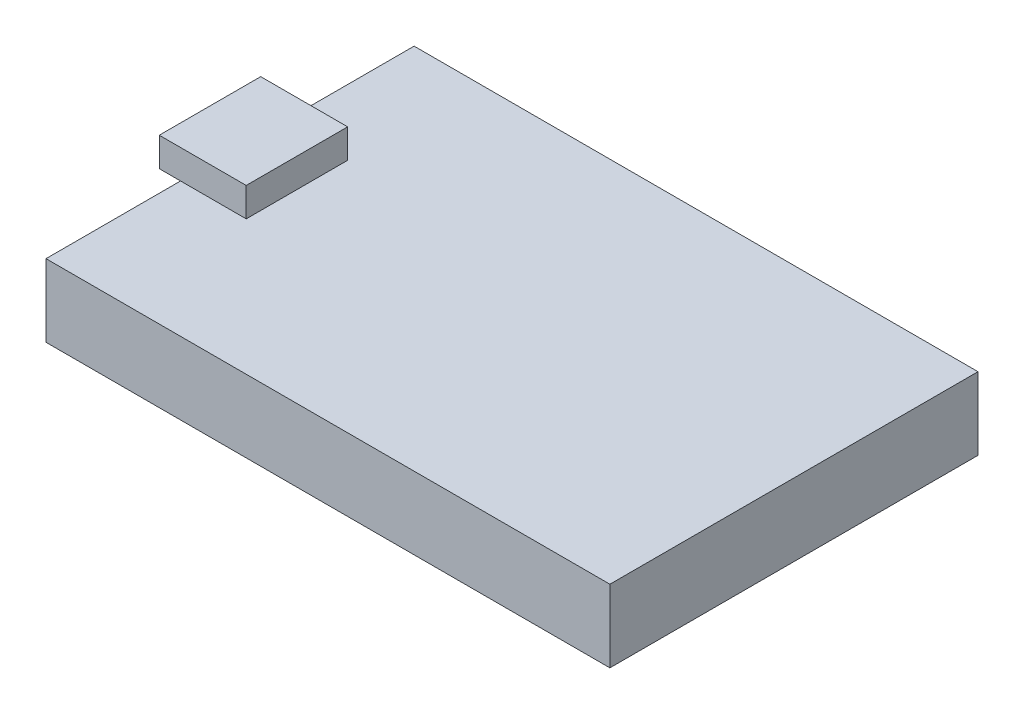
ISO-10303-21;
HEADER;
FILE_DESCRIPTION(('STEP AP214'),'2;1');
FILE_NAME('part.step','',(''),(''),'','','');
FILE_SCHEMA(('AUTOMOTIVE_DESIGN { 1 0 10303 214 1 1 1 1 }'));
ENDSEC;
DATA;
#1=APPLICATION_CONTEXT('core data for automotive mechanical design processes');
#2=APPLICATION_PROTOCOL_DEFINITION('international standard','automotive_design',2000,#1);
#3=PRODUCT_CONTEXT('',#1,'mechanical');
#4=PRODUCT('Part','Part','',(#3));
#5=PRODUCT_RELATED_PRODUCT_CATEGORY('part','',(#4));
#6=PRODUCT_DEFINITION_FORMATION('','',#4);
#7=PRODUCT_DEFINITION_CONTEXT('part definition',#1,'design');
#8=PRODUCT_DEFINITION('design','',#6,#7);
#9=PRODUCT_DEFINITION_SHAPE('','',#8);
#10=(LENGTH_UNIT() NAMED_UNIT(*) SI_UNIT(.MILLI.,.METRE.));
#11=(NAMED_UNIT(*) PLANE_ANGLE_UNIT() SI_UNIT($,.RADIAN.));
#12=(NAMED_UNIT(*) SI_UNIT($,.STERADIAN.) SOLID_ANGLE_UNIT());
#13=UNCERTAINTY_MEASURE_WITH_UNIT(LENGTH_MEASURE(1.E-05),#10,'distance_accuracy_value','');
#14=(GEOMETRIC_REPRESENTATION_CONTEXT(3) GLOBAL_UNCERTAINTY_ASSIGNED_CONTEXT((#13)) GLOBAL_UNIT_ASSIGNED_CONTEXT((#10,
#11,#12)) REPRESENTATION_CONTEXT('',''));
#15=CARTESIAN_POINT('',(0.,0.,0.));
#16=DIRECTION('',(0.,0.,1.));
#17=DIRECTION('',(1.,0.,0.));
#18=AXIS2_PLACEMENT_3D('',#15,#16,#17);
#19=CARTESIAN_POINT('',(0.,5.,0.));
#20=DIRECTION('',(0.,-1.,0.));
#21=DIRECTION('',(0.,0.,-1.));
#22=AXIS2_PLACEMENT_3D('',#19,#20,#21);
#23=PLANE('',#22);
#24=DIRECTION('',(1.,0.,0.));
#25=VECTOR('',#24,1.);
#26=CARTESIAN_POINT('',(-20.9239265115051,5.,3.41604718261589));
#27=LINE('',#26,#25);
#28=CARTESIAN_POINT('',(-19.455,5.,3.41604718261589));
#29=VERTEX_POINT('',#28);
#30=CARTESIAN_POINT('',(-14.9239265115051,5.,3.41604718261589));
#31=VERTEX_POINT('',#30);
#32=EDGE_CURVE('E11',#29,#31,#27,.T.);
#33=ORIENTED_EDGE('',*,*,#32,.F.);
#34=DIRECTION('',(0.,0.,1.));
#35=VECTOR('',#34,1.);
#36=CARTESIAN_POINT('',(-19.455,5.,12.7));
#37=LINE('',#36,#35);
#38=CARTESIAN_POINT('',(-19.455,5.,12.7));
#39=VERTEX_POINT('',#38);
#40=EDGE_CURVE('E157',#29,#39,#37,.T.);
#41=ORIENTED_EDGE('',*,*,#40,.T.);
#42=DIRECTION('',(1.,0.,0.));
#43=VECTOR('',#42,1.);
#44=CARTESIAN_POINT('',(-19.455,5.,12.7));
#45=LINE('',#44,#43);
#46=CARTESIAN_POINT('',(19.455,5.,12.7));
#47=VERTEX_POINT('',#46);
#48=EDGE_CURVE('E161',#39,#47,#45,.T.);
#49=ORIENTED_EDGE('',*,*,#48,.T.);
#50=DIRECTION('',(0.,0.,-1.));
#51=VECTOR('',#50,1.);
#52=CARTESIAN_POINT('',(19.455,5.,12.7));
#53=LINE('',#52,#51);
#54=CARTESIAN_POINT('',(19.455,5.,-12.7));
#55=VERTEX_POINT('',#54);
#56=EDGE_CURVE('E149',#47,#55,#53,.T.);
#57=ORIENTED_EDGE('',*,*,#56,.T.);
#58=DIRECTION('',(-1.,0.,0.));
#59=VECTOR('',#58,1.);
#60=CARTESIAN_POINT('',(-19.455,5.,-12.7));
#61=LINE('',#60,#59);
#62=CARTESIAN_POINT('',(-19.455,5.,-12.7));
#63=VERTEX_POINT('',#62);
#64=EDGE_CURVE('E153',#55,#63,#61,.T.);
#65=ORIENTED_EDGE('',*,*,#64,.T.);
#66=CARTESIAN_POINT('',(-19.455,5.,-3.58395281738411));
#67=VERTEX_POINT('',#66);
#68=EDGE_CURVE('E158',#63,#67,#37,.T.);
#69=ORIENTED_EDGE('',*,*,#68,.T.);
#70=DIRECTION('',(-1.,0.,0.));
#71=VECTOR('',#70,1.);
#72=CARTESIAN_POINT('',(-20.9239265115051,5.,-3.58395281738411));
#73=LINE('',#72,#71);
#74=CARTESIAN_POINT('',(-14.9239265115051,5.,-3.58395281738411));
#75=VERTEX_POINT('',#74);
#76=EDGE_CURVE('E65',#75,#67,#73,.T.);
#77=ORIENTED_EDGE('',*,*,#76,.F.);
#78=DIRECTION('',(0.,0.,-1.));
#79=VECTOR('',#78,1.);
#80=CARTESIAN_POINT('',(-14.9239265115051,5.,3.41604718261589));
#81=LINE('',#80,#79);
#82=EDGE_CURVE('E61',#31,#75,#81,.T.);
#83=ORIENTED_EDGE('',*,*,#82,.F.);
#84=EDGE_LOOP('',(#33,#41,#49,#57,#65,#69,#77,#83));
#85=FACE_BOUND('',#84,.T.);
#86=ADVANCED_FACE('F43',(#85),#23,.F.);
#87=CARTESIAN_POINT('',(19.455,5.,12.7));
#88=DIRECTION('',(-1.,0.,0.));
#89=DIRECTION('',(0.,0.,1.));
#90=AXIS2_PLACEMENT_3D('',#87,#88,#89);
#91=PLANE('',#90);
#92=DIRECTION('',(0.,0.,-1.));
#93=VECTOR('',#92,1.);
#94=CARTESIAN_POINT('',(19.455,0.,12.7));
#95=LINE('',#94,#93);
#96=CARTESIAN_POINT('',(19.455,0.,12.7));
#97=VERTEX_POINT('',#96);
#98=CARTESIAN_POINT('',(19.455,0.,-12.7));
#99=VERTEX_POINT('',#98);
#100=EDGE_CURVE('E138',#97,#99,#95,.T.);
#101=ORIENTED_EDGE('',*,*,#100,.T.);
#102=DIRECTION('',(0.,-1.,0.));
#103=VECTOR('',#102,1.);
#104=CARTESIAN_POINT('',(19.455,5.,-12.7));
#105=LINE('',#104,#103);
#106=EDGE_CURVE('E47',#55,#99,#105,.T.);
#107=ORIENTED_EDGE('',*,*,#106,.F.);
#108=ORIENTED_EDGE('',*,*,#56,.F.);
#109=DIRECTION('',(0.,-1.,0.));
#110=VECTOR('',#109,1.);
#111=CARTESIAN_POINT('',(19.455,5.,12.7));
#112=LINE('',#111,#110);
#113=EDGE_CURVE('E164',#47,#97,#112,.T.);
#114=ORIENTED_EDGE('',*,*,#113,.T.);
#115=EDGE_LOOP('',(#101,#107,#108,#114));
#116=FACE_BOUND('',#115,.T.);
#117=ADVANCED_FACE('F45',(#116),#91,.F.);
#118=CARTESIAN_POINT('',(-19.455,5.,-12.7));
#119=DIRECTION('',(0.,0.,1.));
#120=DIRECTION('',(1.,0.,0.));
#121=AXIS2_PLACEMENT_3D('',#118,#119,#120);
#122=PLANE('',#121);
#123=DIRECTION('',(-1.,0.,0.));
#124=VECTOR('',#123,1.);
#125=CARTESIAN_POINT('',(-19.455,0.,-12.7));
#126=LINE('',#125,#124);
#127=CARTESIAN_POINT('',(-19.455,0.,-12.7));
#128=VERTEX_POINT('',#127);
#129=EDGE_CURVE('E143',#99,#128,#126,.T.);
#130=ORIENTED_EDGE('',*,*,#129,.T.);
#131=DIRECTION('',(0.,-1.,0.));
#132=VECTOR('',#131,1.);
#133=CARTESIAN_POINT('',(-19.455,5.,-12.7));
#134=LINE('',#133,#132);
#135=EDGE_CURVE('E179',#63,#128,#134,.T.);
#136=ORIENTED_EDGE('',*,*,#135,.F.);
#137=ORIENTED_EDGE('',*,*,#64,.F.);
#138=ORIENTED_EDGE('',*,*,#106,.T.);
#139=EDGE_LOOP('',(#130,#136,#137,#138));
#140=FACE_BOUND('',#139,.T.);
#141=ADVANCED_FACE('F190',(#140),#122,.F.);
#142=CARTESIAN_POINT('',(-19.455,5.,12.7));
#143=DIRECTION('',(1.,0.,0.));
#144=DIRECTION('',(0.,0.,-1.));
#145=AXIS2_PLACEMENT_3D('',#142,#143,#144);
#146=PLANE('',#145);
#147=DIRECTION('',(0.,0.,1.));
#148=VECTOR('',#147,1.);
#149=CARTESIAN_POINT('',(-19.455,0.,12.7));
#150=LINE('',#149,#148);
#151=CARTESIAN_POINT('',(-19.455,0.,12.7));
#152=VERTEX_POINT('',#151);
#153=EDGE_CURVE('E168',#128,#152,#150,.T.);
#154=ORIENTED_EDGE('',*,*,#153,.T.);
#155=DIRECTION('',(0.,-1.,0.));
#156=VECTOR('',#155,1.);
#157=CARTESIAN_POINT('',(-19.455,5.,12.7));
#158=LINE('',#157,#156);
#159=EDGE_CURVE('E176',#39,#152,#158,.T.);
#160=ORIENTED_EDGE('',*,*,#159,.F.);
#161=ORIENTED_EDGE('',*,*,#40,.F.);
#162=EDGE_CURVE('E162',#67,#29,#37,.T.);
#163=ORIENTED_EDGE('',*,*,#162,.F.);
#164=ORIENTED_EDGE('',*,*,#68,.F.);
#165=ORIENTED_EDGE('',*,*,#135,.T.);
#166=EDGE_LOOP('',(#154,#160,#161,#163,#164,#165));
#167=FACE_BOUND('',#166,.T.);
#168=ADVANCED_FACE('F199',(#167),#146,.F.);
#169=CARTESIAN_POINT('',(-19.455,5.,12.7));
#170=DIRECTION('',(0.,0.,-1.));
#171=DIRECTION('',(-1.,0.,0.));
#172=AXIS2_PLACEMENT_3D('',#169,#170,#171);
#173=PLANE('',#172);
#174=DIRECTION('',(1.,0.,0.));
#175=VECTOR('',#174,1.);
#176=CARTESIAN_POINT('',(-19.455,0.,12.7));
#177=LINE('',#176,#175);
#178=EDGE_CURVE('E154',#152,#97,#177,.T.);
#179=ORIENTED_EDGE('',*,*,#178,.T.);
#180=ORIENTED_EDGE('',*,*,#113,.F.);
#181=ORIENTED_EDGE('',*,*,#48,.F.);
#182=ORIENTED_EDGE('',*,*,#159,.T.);
#183=EDGE_LOOP('',(#179,#180,#181,#182));
#184=FACE_BOUND('',#183,.T.);
#185=ADVANCED_FACE('F203',(#184),#173,.F.);
#186=CARTESIAN_POINT('',(0.,0.,0.));
#187=DIRECTION('',(0.,-1.,0.));
#188=DIRECTION('',(0.,0.,-1.));
#189=AXIS2_PLACEMENT_3D('',#186,#187,#188);
#190=PLANE('',#189);
#191=ORIENTED_EDGE('',*,*,#100,.F.);
#192=ORIENTED_EDGE('',*,*,#178,.F.);
#193=ORIENTED_EDGE('',*,*,#153,.F.);
#194=ORIENTED_EDGE('',*,*,#129,.F.);
#195=EDGE_LOOP('',(#191,#192,#193,#194));
#196=FACE_BOUND('',#195,.T.);
#197=ADVANCED_FACE('F197',(#196),#190,.T.);
#198=CARTESIAN_POINT('',(-14.9239265115051,7.,3.41604718261589));
#199=DIRECTION('',(-1.,0.,0.));
#200=DIRECTION('',(0.,0.,1.));
#201=AXIS2_PLACEMENT_3D('',#198,#199,#200);
#202=PLANE('',#201);
#203=ORIENTED_EDGE('',*,*,#82,.T.);
#204=DIRECTION('',(0.,-1.,0.));
#205=VECTOR('',#204,1.);
#206=CARTESIAN_POINT('',(-14.9239265115051,7.,-3.58395281738411));
#207=LINE('',#206,#205);
#208=CARTESIAN_POINT('',(-14.9239265115051,7.,-3.58395281738411));
#209=VERTEX_POINT('',#208);
#210=EDGE_CURVE('E118',#209,#75,#207,.T.);
#211=ORIENTED_EDGE('',*,*,#210,.F.);
#212=DIRECTION('',(0.,0.,-1.));
#213=VECTOR('',#212,1.);
#214=CARTESIAN_POINT('',(-14.9239265115051,7.,3.41604718261589));
#215=LINE('',#214,#213);
#216=CARTESIAN_POINT('',(-14.9239265115051,7.,3.41604718261589));
#217=VERTEX_POINT('',#216);
#218=EDGE_CURVE('E125',#217,#209,#215,.T.);
#219=ORIENTED_EDGE('',*,*,#218,.F.);
#220=DIRECTION('',(0.,-1.,0.));
#221=VECTOR('',#220,1.);
#222=CARTESIAN_POINT('',(-14.9239265115051,7.,3.41604718261589));
#223=LINE('',#222,#221);
#224=EDGE_CURVE('E225',#217,#31,#223,.T.);
#225=ORIENTED_EDGE('',*,*,#224,.T.);
#226=EDGE_LOOP('',(#203,#211,#219,#225));
#227=FACE_BOUND('',#226,.T.);
#228=ADVANCED_FACE('F136',(#227),#202,.F.);
#229=CARTESIAN_POINT('',(-20.9239265115051,7.,-3.58395281738411));
#230=DIRECTION('',(0.,0.,1.));
#231=DIRECTION('',(1.,0.,0.));
#232=AXIS2_PLACEMENT_3D('',#229,#230,#231);
#233=PLANE('',#232);
#234=ORIENTED_EDGE('',*,*,#76,.T.);
#235=CARTESIAN_POINT('',(-20.9239265115051,5.,-3.58395281738411));
#236=VERTEX_POINT('',#235);
#237=EDGE_CURVE('E214',#67,#236,#73,.T.);
#238=ORIENTED_EDGE('',*,*,#237,.T.);
#239=DIRECTION('',(0.,-1.,0.));
#240=VECTOR('',#239,1.);
#241=CARTESIAN_POINT('',(-20.9239265115051,7.,-3.58395281738411));
#242=LINE('',#241,#240);
#243=CARTESIAN_POINT('',(-20.9239265115051,7.,-3.58395281738411));
#244=VERTEX_POINT('',#243);
#245=EDGE_CURVE('E120',#244,#236,#242,.T.);
#246=ORIENTED_EDGE('',*,*,#245,.F.);
#247=DIRECTION('',(-1.,0.,0.));
#248=VECTOR('',#247,1.);
#249=CARTESIAN_POINT('',(-20.9239265115051,7.,-3.58395281738411));
#250=LINE('',#249,#248);
#251=EDGE_CURVE('E114',#209,#244,#250,.T.);
#252=ORIENTED_EDGE('',*,*,#251,.F.);
#253=ORIENTED_EDGE('',*,*,#210,.T.);
#254=EDGE_LOOP('',(#234,#238,#246,#252,#253));
#255=FACE_BOUND('',#254,.T.);
#256=ADVANCED_FACE('F116',(#255),#233,.F.);
#257=CARTESIAN_POINT('',(-20.9239265115051,7.,3.41604718261589));
#258=DIRECTION('',(1.,0.,0.));
#259=DIRECTION('',(0.,0.,-1.));
#260=AXIS2_PLACEMENT_3D('',#257,#258,#259);
#261=PLANE('',#260);
#262=DIRECTION('',(0.,0.,1.));
#263=VECTOR('',#262,1.);
#264=CARTESIAN_POINT('',(-20.9239265115051,5.,3.41604718261589));
#265=LINE('',#264,#263);
#266=CARTESIAN_POINT('',(-20.9239265115051,5.,3.41604718261589));
#267=VERTEX_POINT('',#266);
#268=EDGE_CURVE('E220',#236,#267,#265,.T.);
#269=ORIENTED_EDGE('',*,*,#268,.T.);
#270=DIRECTION('',(0.,-1.,0.));
#271=VECTOR('',#270,1.);
#272=CARTESIAN_POINT('',(-20.9239265115051,7.,3.41604718261589));
#273=LINE('',#272,#271);
#274=CARTESIAN_POINT('',(-20.9239265115051,7.,3.41604718261589));
#275=VERTEX_POINT('',#274);
#276=EDGE_CURVE('E145',#275,#267,#273,.T.);
#277=ORIENTED_EDGE('',*,*,#276,.F.);
#278=DIRECTION('',(0.,0.,1.));
#279=VECTOR('',#278,1.);
#280=CARTESIAN_POINT('',(-20.9239265115051,7.,3.41604718261589));
#281=LINE('',#280,#279);
#282=EDGE_CURVE('E124',#244,#275,#281,.T.);
#283=ORIENTED_EDGE('',*,*,#282,.F.);
#284=ORIENTED_EDGE('',*,*,#245,.T.);
#285=EDGE_LOOP('',(#269,#277,#283,#284));
#286=FACE_BOUND('',#285,.T.);
#287=ADVANCED_FACE('F237',(#286),#261,.F.);
#288=CARTESIAN_POINT('',(-20.9239265115051,7.,3.41604718261589));
#289=DIRECTION('',(0.,0.,-1.));
#290=DIRECTION('',(-1.,0.,0.));
#291=AXIS2_PLACEMENT_3D('',#288,#289,#290);
#292=PLANE('',#291);
#293=EDGE_CURVE('E54',#267,#29,#27,.T.);
#294=ORIENTED_EDGE('',*,*,#293,.T.);
#295=ORIENTED_EDGE('',*,*,#32,.T.);
#296=ORIENTED_EDGE('',*,*,#224,.F.);
#297=DIRECTION('',(1.,0.,0.));
#298=VECTOR('',#297,1.);
#299=CARTESIAN_POINT('',(-20.9239265115051,7.,3.41604718261589));
#300=LINE('',#299,#298);
#301=EDGE_CURVE('E130',#275,#217,#300,.T.);
#302=ORIENTED_EDGE('',*,*,#301,.F.);
#303=ORIENTED_EDGE('',*,*,#276,.T.);
#304=EDGE_LOOP('',(#294,#295,#296,#302,#303));
#305=FACE_BOUND('',#304,.T.);
#306=ADVANCED_FACE('F217',(#305),#292,.F.);
#307=CARTESIAN_POINT('',(0.,7.,0.));
#308=DIRECTION('',(0.,-1.,0.));
#309=DIRECTION('',(0.,0.,-1.));
#310=AXIS2_PLACEMENT_3D('',#307,#308,#309);
#311=PLANE('',#310);
#312=ORIENTED_EDGE('',*,*,#218,.T.);
#313=ORIENTED_EDGE('',*,*,#251,.T.);
#314=ORIENTED_EDGE('',*,*,#282,.T.);
#315=ORIENTED_EDGE('',*,*,#301,.T.);
#316=EDGE_LOOP('',(#312,#313,#314,#315));
#317=FACE_BOUND('',#316,.T.);
#318=ADVANCED_FACE('F128',(#317),#311,.F.);
#319=CARTESIAN_POINT('',(0.,5.,0.));
#320=DIRECTION('',(0.,-1.,0.));
#321=DIRECTION('',(0.,0.,-1.));
#322=AXIS2_PLACEMENT_3D('',#319,#320,#321);
#323=PLANE('',#322);
#324=ORIENTED_EDGE('',*,*,#237,.F.);
#325=ORIENTED_EDGE('',*,*,#162,.T.);
#326=ORIENTED_EDGE('',*,*,#293,.F.);
#327=ORIENTED_EDGE('',*,*,#268,.F.);
#328=EDGE_LOOP('',(#324,#325,#326,#327));
#329=FACE_BOUND('',#328,.T.);
#330=ADVANCED_FACE('F212',(#329),#323,.T.);
#331=CLOSED_SHELL('',(#86,#117,#141,#168,#185,#197,#228,#256,#287,#306,#318,#330));
#332=MANIFOLD_SOLID_BREP('B2',#331);
#333=ADVANCED_BREP_SHAPE_REPRESENTATION('',(#18,#332),#14);
#334=SHAPE_DEFINITION_REPRESENTATION(#9,#333);
ENDSEC;
END-ISO-10303-21;
